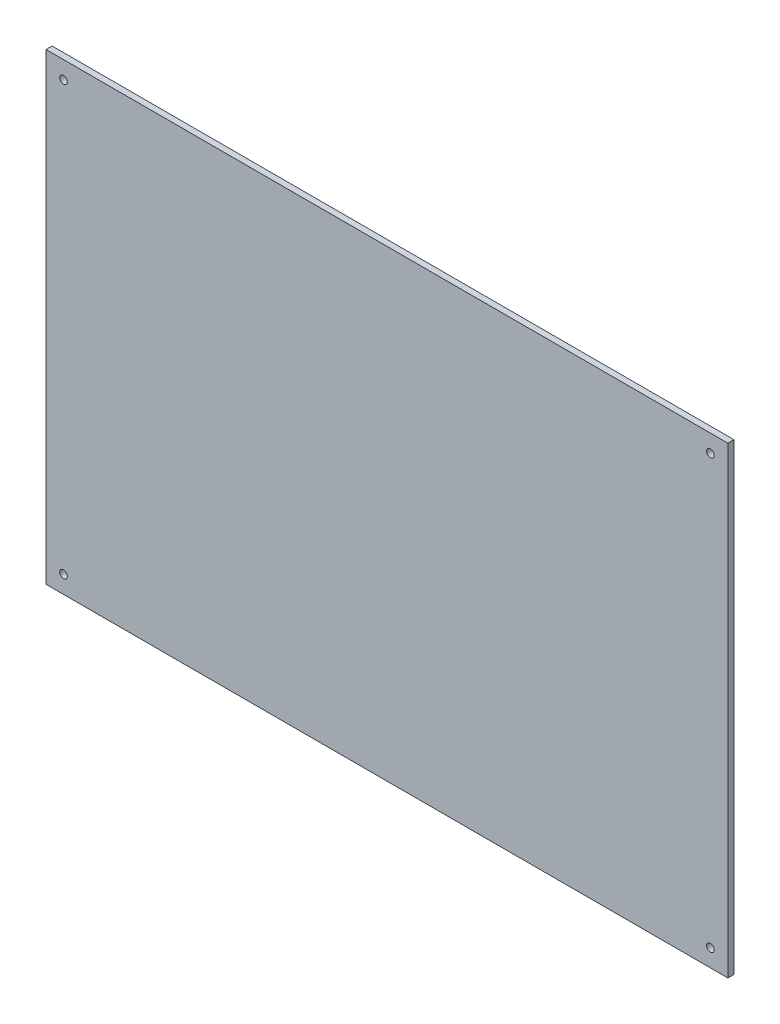
ISO-10303-21;
HEADER;
FILE_DESCRIPTION(('STEP AP214'),'2;1');
FILE_NAME('part.step','',(''),(''),'','','');
FILE_SCHEMA(('AUTOMOTIVE_DESIGN { 1 0 10303 214 1 1 1 1 }'));
ENDSEC;
DATA;
#1=APPLICATION_CONTEXT('core data for automotive mechanical design processes');
#2=APPLICATION_PROTOCOL_DEFINITION('international standard','automotive_design',2000,#1);
#3=PRODUCT_CONTEXT('',#1,'mechanical');
#4=PRODUCT('Part','Part','',(#3));
#5=PRODUCT_RELATED_PRODUCT_CATEGORY('part','',(#4));
#6=PRODUCT_DEFINITION_FORMATION('','',#4);
#7=PRODUCT_DEFINITION_CONTEXT('part definition',#1,'design');
#8=PRODUCT_DEFINITION('design','',#6,#7);
#9=PRODUCT_DEFINITION_SHAPE('','',#8);
#10=(LENGTH_UNIT() NAMED_UNIT(*) SI_UNIT(.MILLI.,.METRE.));
#11=(NAMED_UNIT(*) PLANE_ANGLE_UNIT() SI_UNIT($,.RADIAN.));
#12=(NAMED_UNIT(*) SI_UNIT($,.STERADIAN.) SOLID_ANGLE_UNIT());
#13=UNCERTAINTY_MEASURE_WITH_UNIT(LENGTH_MEASURE(1.E-05),#10,'distance_accuracy_value','');
#14=(GEOMETRIC_REPRESENTATION_CONTEXT(3) GLOBAL_UNCERTAINTY_ASSIGNED_CONTEXT((#13)) GLOBAL_UNIT_ASSIGNED_CONTEXT((#10,
#11,#12)) REPRESENTATION_CONTEXT('',''));
#15=CARTESIAN_POINT('',(0.,0.,0.));
#16=DIRECTION('',(0.,0.,1.));
#17=DIRECTION('',(1.,0.,0.));
#18=AXIS2_PLACEMENT_3D('',#15,#16,#17);
#19=CARTESIAN_POINT('',(0.,0.,4.));
#20=DIRECTION('',(0.,0.,1.));
#21=DIRECTION('',(1.,0.,0.));
#22=AXIS2_PLACEMENT_3D('',#19,#20,#21);
#23=PLANE('',#22);
#24=CARTESIAN_POINT('',(-11.5000000000001,293.5,4.));
#25=DIRECTION('',(0.,0.,1.));
#26=DIRECTION('',(-1.,0.,0.));
#27=AXIS2_PLACEMENT_3D('',#24,#25,#26);
#28=CIRCLE('',#27,2.50000000000002);
#29=CARTESIAN_POINT('',(-14.0000000000001,293.5,4.));
#30=VERTEX_POINT('',#29);
#31=EDGE_CURVE('E122',#30,#30,#28,.T.);
#32=ORIENTED_EDGE('',*,*,#31,.F.);
#33=EDGE_LOOP('',(#32));
#34=FACE_BOUND('',#33,.T.);
#35=CARTESIAN_POINT('',(-437.5,293.5,4.));
#36=DIRECTION('',(0.,0.,1.));
#37=DIRECTION('',(1.,0.,0.));
#38=AXIS2_PLACEMENT_3D('',#35,#36,#37);
#39=CIRCLE('',#38,2.50000000000002);
#40=CARTESIAN_POINT('',(-435.,293.5,4.));
#41=VERTEX_POINT('',#40);
#42=EDGE_CURVE('E101',#41,#41,#39,.T.);
#43=ORIENTED_EDGE('',*,*,#42,.F.);
#44=EDGE_LOOP('',(#43));
#45=FACE_BOUND('',#44,.T.);
#46=DIRECTION('',(0.,1.,0.));
#47=VECTOR('',#46,1.);
#48=CARTESIAN_POINT('',(0.,0.,4.));
#49=LINE('',#48,#47);
#50=CARTESIAN_POINT('',(0.,0.,4.));
#51=VERTEX_POINT('',#50);
#52=CARTESIAN_POINT('',(-1.11022302462516E-13,305.,4.));
#53=VERTEX_POINT('',#52);
#54=EDGE_CURVE('E86',#51,#53,#49,.T.);
#55=ORIENTED_EDGE('',*,*,#54,.T.);
#56=DIRECTION('',(-1.,0.,0.));
#57=VECTOR('',#56,1.);
#58=CARTESIAN_POINT('',(-1.11022302462516E-13,305.,4.));
#59=LINE('',#58,#57);
#60=CARTESIAN_POINT('',(-449.,305.,4.));
#61=VERTEX_POINT('',#60);
#62=EDGE_CURVE('E81',#53,#61,#59,.T.);
#63=ORIENTED_EDGE('',*,*,#62,.T.);
#64=DIRECTION('',(0.,-1.,0.));
#65=VECTOR('',#64,1.);
#66=CARTESIAN_POINT('',(-449.,0.,4.));
#67=LINE('',#66,#65);
#68=CARTESIAN_POINT('',(-449.,0.,4.));
#69=VERTEX_POINT('',#68);
#70=EDGE_CURVE('E84',#61,#69,#67,.T.);
#71=ORIENTED_EDGE('',*,*,#70,.T.);
#72=DIRECTION('',(1.,0.,0.));
#73=VECTOR('',#72,1.);
#74=CARTESIAN_POINT('',(0.,0.,4.));
#75=LINE('',#74,#73);
#76=EDGE_CURVE('E51',#69,#51,#75,.T.);
#77=ORIENTED_EDGE('',*,*,#76,.T.);
#78=EDGE_LOOP('',(#55,#63,#71,#77));
#79=FACE_BOUND('',#78,.T.);
#80=CARTESIAN_POINT('',(-437.5,11.5,4.));
#81=DIRECTION('',(0.,0.,1.));
#82=DIRECTION('',(-1.,0.,0.));
#83=AXIS2_PLACEMENT_3D('',#80,#81,#82);
#84=CIRCLE('',#83,2.50000000000002);
#85=CARTESIAN_POINT('',(-440.,11.5,4.));
#86=VERTEX_POINT('',#85);
#87=EDGE_CURVE('E116',#86,#86,#84,.T.);
#88=ORIENTED_EDGE('',*,*,#87,.F.);
#89=EDGE_LOOP('',(#88));
#90=FACE_BOUND('',#89,.T.);
#91=CARTESIAN_POINT('',(-11.5000000000001,11.5,4.));
#92=DIRECTION('',(0.,0.,1.));
#93=DIRECTION('',(1.,0.,0.));
#94=AXIS2_PLACEMENT_3D('',#91,#92,#93);
#95=CIRCLE('',#94,2.50000000000002);
#96=CARTESIAN_POINT('',(-9.00000000000005,11.5,4.));
#97=VERTEX_POINT('',#96);
#98=EDGE_CURVE('E128',#97,#97,#95,.T.);
#99=ORIENTED_EDGE('',*,*,#98,.F.);
#100=EDGE_LOOP('',(#99));
#101=FACE_BOUND('',#100,.T.);
#102=ADVANCED_FACE('F34',(#34,#45,#79,#90,#101),#23,.T.);
#103=CARTESIAN_POINT('',(0.,0.,0.));
#104=DIRECTION('',(0.,0.,1.));
#105=DIRECTION('',(1.,0.,0.));
#106=AXIS2_PLACEMENT_3D('',#103,#104,#105);
#107=PLANE('',#106);
#108=DIRECTION('',(0.,1.,0.));
#109=VECTOR('',#108,1.);
#110=CARTESIAN_POINT('',(0.,0.,0.));
#111=LINE('',#110,#109);
#112=CARTESIAN_POINT('',(0.,0.,0.));
#113=VERTEX_POINT('',#112);
#114=CARTESIAN_POINT('',(-1.11022302462516E-13,305.,0.));
#115=VERTEX_POINT('',#114);
#116=EDGE_CURVE('E98',#113,#115,#111,.T.);
#117=ORIENTED_EDGE('',*,*,#116,.F.);
#118=DIRECTION('',(1.,0.,0.));
#119=VECTOR('',#118,1.);
#120=CARTESIAN_POINT('',(0.,0.,0.));
#121=LINE('',#120,#119);
#122=CARTESIAN_POINT('',(-449.,0.,0.));
#123=VERTEX_POINT('',#122);
#124=EDGE_CURVE('E74',#123,#113,#121,.T.);
#125=ORIENTED_EDGE('',*,*,#124,.F.);
#126=DIRECTION('',(0.,-1.,0.));
#127=VECTOR('',#126,1.);
#128=CARTESIAN_POINT('',(-449.,0.,0.));
#129=LINE('',#128,#127);
#130=CARTESIAN_POINT('',(-449.,305.,0.));
#131=VERTEX_POINT('',#130);
#132=EDGE_CURVE('E68',#131,#123,#129,.T.);
#133=ORIENTED_EDGE('',*,*,#132,.F.);
#134=DIRECTION('',(-1.,0.,0.));
#135=VECTOR('',#134,1.);
#136=CARTESIAN_POINT('',(-1.11022302462516E-13,305.,0.));
#137=LINE('',#136,#135);
#138=EDGE_CURVE('E90',#115,#131,#137,.T.);
#139=ORIENTED_EDGE('',*,*,#138,.F.);
#140=EDGE_LOOP('',(#117,#125,#133,#139));
#141=FACE_BOUND('',#140,.T.);
#142=CARTESIAN_POINT('',(-437.5,293.5,0.));
#143=DIRECTION('',(0.,0.,1.));
#144=DIRECTION('',(1.,0.,0.));
#145=AXIS2_PLACEMENT_3D('',#142,#143,#144);
#146=CIRCLE('',#145,2.50000000000002);
#147=CARTESIAN_POINT('',(-435.,293.5,0.));
#148=VERTEX_POINT('',#147);
#149=EDGE_CURVE('E113',#148,#148,#146,.T.);
#150=ORIENTED_EDGE('',*,*,#149,.T.);
#151=EDGE_LOOP('',(#150));
#152=FACE_BOUND('',#151,.T.);
#153=CARTESIAN_POINT('',(-437.5,11.5,0.));
#154=DIRECTION('',(0.,0.,1.));
#155=DIRECTION('',(-1.,0.,0.));
#156=AXIS2_PLACEMENT_3D('',#153,#154,#155);
#157=CIRCLE('',#156,2.50000000000002);
#158=CARTESIAN_POINT('',(-440.,11.5,0.));
#159=VERTEX_POINT('',#158);
#160=EDGE_CURVE('E119',#159,#159,#157,.T.);
#161=ORIENTED_EDGE('',*,*,#160,.T.);
#162=EDGE_LOOP('',(#161));
#163=FACE_BOUND('',#162,.T.);
#164=CARTESIAN_POINT('',(-11.5000000000001,293.5,0.));
#165=DIRECTION('',(0.,0.,1.));
#166=DIRECTION('',(-1.,0.,0.));
#167=AXIS2_PLACEMENT_3D('',#164,#165,#166);
#168=CIRCLE('',#167,2.50000000000002);
#169=CARTESIAN_POINT('',(-14.0000000000001,293.5,0.));
#170=VERTEX_POINT('',#169);
#171=EDGE_CURVE('E125',#170,#170,#168,.T.);
#172=ORIENTED_EDGE('',*,*,#171,.T.);
#173=EDGE_LOOP('',(#172));
#174=FACE_BOUND('',#173,.T.);
#175=CARTESIAN_POINT('',(-11.5000000000001,11.5,0.));
#176=DIRECTION('',(0.,0.,1.));
#177=DIRECTION('',(1.,0.,0.));
#178=AXIS2_PLACEMENT_3D('',#175,#176,#177);
#179=CIRCLE('',#178,2.50000000000002);
#180=CARTESIAN_POINT('',(-9.00000000000005,11.5,0.));
#181=VERTEX_POINT('',#180);
#182=EDGE_CURVE('E131',#181,#181,#179,.T.);
#183=ORIENTED_EDGE('',*,*,#182,.T.);
#184=EDGE_LOOP('',(#183));
#185=FACE_BOUND('',#184,.T.);
#186=ADVANCED_FACE('F109',(#141,#152,#163,#174,#185),#107,.F.);
#187=CARTESIAN_POINT('',(0.,0.,4.));
#188=DIRECTION('',(-1.,0.,0.));
#189=DIRECTION('',(0.,-1.,0.));
#190=AXIS2_PLACEMENT_3D('',#187,#188,#189);
#191=PLANE('',#190);
#192=ORIENTED_EDGE('',*,*,#116,.T.);
#193=DIRECTION('',(0.,0.,-1.));
#194=VECTOR('',#193,1.);
#195=CARTESIAN_POINT('',(-1.11022302462516E-13,305.,4.));
#196=LINE('',#195,#194);
#197=EDGE_CURVE('E11',#53,#115,#196,.T.);
#198=ORIENTED_EDGE('',*,*,#197,.F.);
#199=ORIENTED_EDGE('',*,*,#54,.F.);
#200=DIRECTION('',(0.,0.,-1.));
#201=VECTOR('',#200,1.);
#202=CARTESIAN_POINT('',(0.,0.,4.));
#203=LINE('',#202,#201);
#204=EDGE_CURVE('E94',#51,#113,#203,.T.);
#205=ORIENTED_EDGE('',*,*,#204,.T.);
#206=EDGE_LOOP('',(#192,#198,#199,#205));
#207=FACE_BOUND('',#206,.T.);
#208=ADVANCED_FACE('F36',(#207),#191,.F.);
#209=CARTESIAN_POINT('',(-1.11022302462516E-13,305.,4.));
#210=DIRECTION('',(0.,-1.,0.));
#211=DIRECTION('',(1.,0.,0.));
#212=AXIS2_PLACEMENT_3D('',#209,#210,#211);
#213=PLANE('',#212);
#214=ORIENTED_EDGE('',*,*,#138,.T.);
#215=DIRECTION('',(0.,0.,-1.));
#216=VECTOR('',#215,1.);
#217=CARTESIAN_POINT('',(-449.,305.,4.));
#218=LINE('',#217,#216);
#219=EDGE_CURVE('E43',#61,#131,#218,.T.);
#220=ORIENTED_EDGE('',*,*,#219,.F.);
#221=ORIENTED_EDGE('',*,*,#62,.F.);
#222=ORIENTED_EDGE('',*,*,#197,.T.);
#223=EDGE_LOOP('',(#214,#220,#221,#222));
#224=FACE_BOUND('',#223,.T.);
#225=ADVANCED_FACE('F89',(#224),#213,.F.);
#226=CARTESIAN_POINT('',(-449.,0.,4.));
#227=DIRECTION('',(1.,0.,0.));
#228=DIRECTION('',(0.,1.,0.));
#229=AXIS2_PLACEMENT_3D('',#226,#227,#228);
#230=PLANE('',#229);
#231=ORIENTED_EDGE('',*,*,#132,.T.);
#232=DIRECTION('',(0.,0.,-1.));
#233=VECTOR('',#232,1.);
#234=CARTESIAN_POINT('',(-449.,0.,4.));
#235=LINE('',#234,#233);
#236=EDGE_CURVE('E91',#69,#123,#235,.T.);
#237=ORIENTED_EDGE('',*,*,#236,.F.);
#238=ORIENTED_EDGE('',*,*,#70,.F.);
#239=ORIENTED_EDGE('',*,*,#219,.T.);
#240=EDGE_LOOP('',(#231,#237,#238,#239));
#241=FACE_BOUND('',#240,.T.);
#242=ADVANCED_FACE('F92',(#241),#230,.F.);
#243=CARTESIAN_POINT('',(0.,0.,4.));
#244=DIRECTION('',(0.,1.,0.));
#245=DIRECTION('',(-1.,0.,0.));
#246=AXIS2_PLACEMENT_3D('',#243,#244,#245);
#247=PLANE('',#246);
#248=ORIENTED_EDGE('',*,*,#124,.T.);
#249=ORIENTED_EDGE('',*,*,#204,.F.);
#250=ORIENTED_EDGE('',*,*,#76,.F.);
#251=ORIENTED_EDGE('',*,*,#236,.T.);
#252=EDGE_LOOP('',(#248,#249,#250,#251));
#253=FACE_BOUND('',#252,.T.);
#254=ADVANCED_FACE('F106',(#253),#247,.F.);
#255=CARTESIAN_POINT('',(-437.5,293.5,4.));
#256=DIRECTION('',(0.,0.,-1.));
#257=DIRECTION('',(-1.,0.,0.));
#258=AXIS2_PLACEMENT_3D('',#255,#256,#257);
#259=CYLINDRICAL_SURFACE('',#258,2.50000000000002);
#260=ORIENTED_EDGE('',*,*,#42,.T.);
#261=EDGE_LOOP('',(#260));
#262=FACE_BOUND('',#261,.T.);
#263=ORIENTED_EDGE('',*,*,#149,.F.);
#264=EDGE_LOOP('',(#263));
#265=FACE_BOUND('',#264,.T.);
#266=ADVANCED_FACE('F150',(#262,#265),#259,.F.);
#267=CARTESIAN_POINT('',(-437.5,11.5,4.));
#268=DIRECTION('',(0.,0.,-1.));
#269=DIRECTION('',(-1.,0.,0.));
#270=AXIS2_PLACEMENT_3D('',#267,#268,#269);
#271=CYLINDRICAL_SURFACE('',#270,2.50000000000002);
#272=ORIENTED_EDGE('',*,*,#87,.T.);
#273=EDGE_LOOP('',(#272));
#274=FACE_BOUND('',#273,.T.);
#275=ORIENTED_EDGE('',*,*,#160,.F.);
#276=EDGE_LOOP('',(#275));
#277=FACE_BOUND('',#276,.T.);
#278=ADVANCED_FACE('F198',(#274,#277),#271,.F.);
#279=CARTESIAN_POINT('',(-11.5000000000001,293.5,4.));
#280=DIRECTION('',(0.,0.,-1.));
#281=DIRECTION('',(-1.,0.,0.));
#282=AXIS2_PLACEMENT_3D('',#279,#280,#281);
#283=CYLINDRICAL_SURFACE('',#282,2.50000000000002);
#284=ORIENTED_EDGE('',*,*,#31,.T.);
#285=EDGE_LOOP('',(#284));
#286=FACE_BOUND('',#285,.T.);
#287=ORIENTED_EDGE('',*,*,#171,.F.);
#288=EDGE_LOOP('',(#287));
#289=FACE_BOUND('',#288,.T.);
#290=ADVANCED_FACE('F206',(#286,#289),#283,.F.);
#291=CARTESIAN_POINT('',(-11.5000000000001,11.5,4.));
#292=DIRECTION('',(0.,0.,-1.));
#293=DIRECTION('',(-1.,0.,0.));
#294=AXIS2_PLACEMENT_3D('',#291,#292,#293);
#295=CYLINDRICAL_SURFACE('',#294,2.50000000000002);
#296=ORIENTED_EDGE('',*,*,#98,.T.);
#297=EDGE_LOOP('',(#296));
#298=FACE_BOUND('',#297,.T.);
#299=ORIENTED_EDGE('',*,*,#182,.F.);
#300=EDGE_LOOP('',(#299));
#301=FACE_BOUND('',#300,.T.);
#302=ADVANCED_FACE('F137',(#298,#301),#295,.F.);
#303=CLOSED_SHELL('',(#102,#186,#208,#225,#242,#254,#266,#278,#290,#302));
#304=MANIFOLD_SOLID_BREP('B2',#303);
#305=ADVANCED_BREP_SHAPE_REPRESENTATION('',(#18,#304),#14);
#306=SHAPE_DEFINITION_REPRESENTATION(#9,#305);
ENDSEC;
END-ISO-10303-21;
